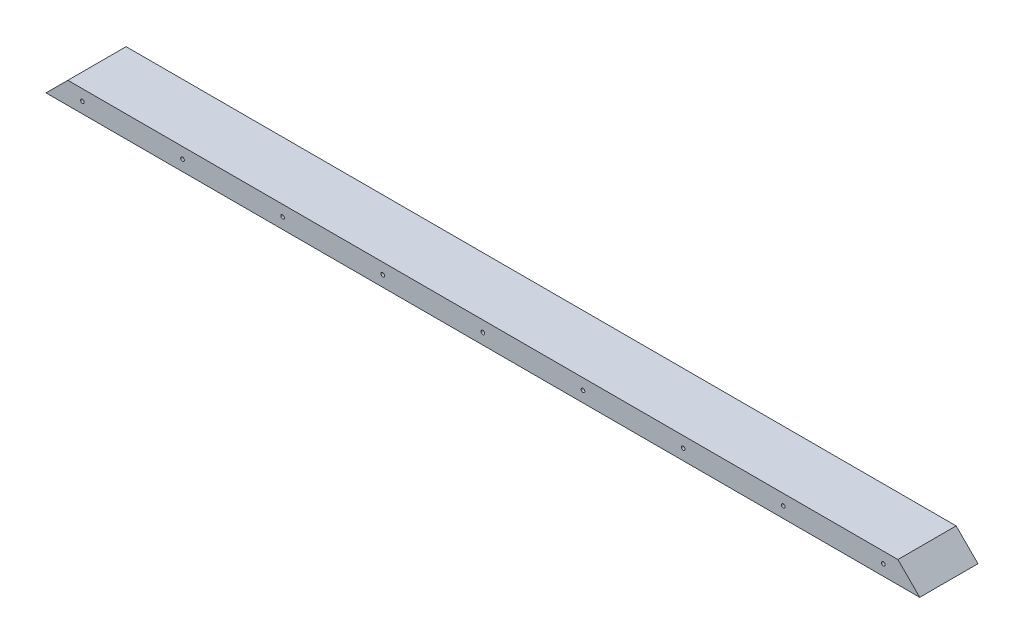
ISO-10303-21;
HEADER;
FILE_DESCRIPTION(('STEP AP214'),'2;1');
FILE_NAME('part.step','',(''),(''),'','','');
FILE_SCHEMA(('AUTOMOTIVE_DESIGN { 1 0 10303 214 1 1 1 1 }'));
ENDSEC;
DATA;
#1=APPLICATION_CONTEXT('core data for automotive mechanical design processes');
#2=APPLICATION_PROTOCOL_DEFINITION('international standard','automotive_design',2000,#1);
#3=PRODUCT_CONTEXT('',#1,'mechanical');
#4=PRODUCT('Part','Part','',(#3));
#5=PRODUCT_RELATED_PRODUCT_CATEGORY('part','',(#4));
#6=PRODUCT_DEFINITION_FORMATION('','',#4);
#7=PRODUCT_DEFINITION_CONTEXT('part definition',#1,'design');
#8=PRODUCT_DEFINITION('design','',#6,#7);
#9=PRODUCT_DEFINITION_SHAPE('','',#8);
#10=(LENGTH_UNIT() NAMED_UNIT(*) SI_UNIT(.MILLI.,.METRE.));
#11=(NAMED_UNIT(*) PLANE_ANGLE_UNIT() SI_UNIT($,.RADIAN.));
#12=(NAMED_UNIT(*) SI_UNIT($,.STERADIAN.) SOLID_ANGLE_UNIT());
#13=UNCERTAINTY_MEASURE_WITH_UNIT(LENGTH_MEASURE(1.E-05),#10,'distance_accuracy_value','');
#14=(GEOMETRIC_REPRESENTATION_CONTEXT(3) GLOBAL_UNCERTAINTY_ASSIGNED_CONTEXT((#13)) GLOBAL_UNIT_ASSIGNED_CONTEXT((#10,
#11,#12)) REPRESENTATION_CONTEXT('',''));
#15=CARTESIAN_POINT('',(0.,0.,0.));
#16=DIRECTION('',(0.,0.,1.));
#17=DIRECTION('',(1.,0.,0.));
#18=AXIS2_PLACEMENT_3D('',#15,#16,#17);
#19=CARTESIAN_POINT('',(600.,15.,20.));
#20=DIRECTION('',(0.,0.,-1.));
#21=DIRECTION('',(0.,1.,0.));
#22=AXIS2_PLACEMENT_3D('',#19,#20,#21);
#23=PLANE('',#22);
#24=CARTESIAN_POINT('',(300.,7.49999999999784,20.));
#25=DIRECTION('',(0.,0.,-1.));
#26=DIRECTION('',(0.,1.,0.));
#27=AXIS2_PLACEMENT_3D('',#24,#25,#26);
#28=CIRCLE('',#27,1.25000000000005);
#29=CARTESIAN_POINT('',(300.,8.74999999999788,20.));
#30=VERTEX_POINT('',#29);
#31=EDGE_CURVE('E170',#30,#30,#28,.T.);
#32=ORIENTED_EDGE('',*,*,#31,.T.);
#33=EDGE_LOOP('',(#32));
#34=FACE_BOUND('',#33,.T.);
#35=CARTESIAN_POINT('',(575.,7.49999999999584,20.));
#36=DIRECTION('',(0.,0.,-1.));
#37=DIRECTION('',(0.,-1.,0.));
#38=AXIS2_PLACEMENT_3D('',#35,#36,#37);
#39=CIRCLE('',#38,1.25000000000002);
#40=CARTESIAN_POINT('',(575.,6.24999999999582,20.));
#41=VERTEX_POINT('',#40);
#42=EDGE_CURVE('E137',#41,#41,#39,.T.);
#43=ORIENTED_EDGE('',*,*,#42,.T.);
#44=EDGE_LOOP('',(#43));
#45=FACE_BOUND('',#44,.T.);
#46=CARTESIAN_POINT('',(506.25,7.49999999999639,20.));
#47=DIRECTION('',(0.,0.,-1.));
#48=DIRECTION('',(0.,-1.,0.));
#49=AXIS2_PLACEMENT_3D('',#46,#47,#48);
#50=CIRCLE('',#49,1.25000000000005);
#51=CARTESIAN_POINT('',(506.25,6.24999999999635,20.));
#52=VERTEX_POINT('',#51);
#53=EDGE_CURVE('E131',#52,#52,#50,.T.);
#54=ORIENTED_EDGE('',*,*,#53,.T.);
#55=EDGE_LOOP('',(#54));
#56=FACE_BOUND('',#55,.T.);
#57=CARTESIAN_POINT('',(437.5,7.49999999999684,20.));
#58=DIRECTION('',(0.,0.,-1.));
#59=DIRECTION('',(0.,-1.,0.));
#60=AXIS2_PLACEMENT_3D('',#57,#58,#59);
#61=CIRCLE('',#60,1.25000000000005);
#62=CARTESIAN_POINT('',(437.5,6.24999999999679,20.));
#63=VERTEX_POINT('',#62);
#64=EDGE_CURVE('E125',#63,#63,#61,.T.);
#65=ORIENTED_EDGE('',*,*,#64,.T.);
#66=EDGE_LOOP('',(#65));
#67=FACE_BOUND('',#66,.T.);
#68=CARTESIAN_POINT('',(368.75,7.49999999999739,20.));
#69=DIRECTION('',(0.,0.,-1.));
#70=DIRECTION('',(0.,-1.,0.));
#71=AXIS2_PLACEMENT_3D('',#68,#69,#70);
#72=CIRCLE('',#71,1.25000000000008);
#73=CARTESIAN_POINT('',(368.75,6.24999999999731,20.));
#74=VERTEX_POINT('',#73);
#75=EDGE_CURVE('E119',#74,#74,#72,.T.);
#76=ORIENTED_EDGE('',*,*,#75,.T.);
#77=EDGE_LOOP('',(#76));
#78=FACE_BOUND('',#77,.T.);
#79=CARTESIAN_POINT('',(231.25,7.49999999999828,20.));
#80=DIRECTION('',(0.,0.,-1.));
#81=DIRECTION('',(0.,1.,0.));
#82=AXIS2_PLACEMENT_3D('',#79,#80,#81);
#83=CIRCLE('',#82,1.24999999999962);
#84=CARTESIAN_POINT('',(231.25,8.7499999999979,20.));
#85=VERTEX_POINT('',#84);
#86=EDGE_CURVE('E113',#85,#85,#83,.T.);
#87=ORIENTED_EDGE('',*,*,#86,.T.);
#88=EDGE_LOOP('',(#87));
#89=FACE_BOUND('',#88,.T.);
#90=CARTESIAN_POINT('',(162.5,7.49999999999872,20.));
#91=DIRECTION('',(0.,0.,-1.));
#92=DIRECTION('',(0.,1.,0.));
#93=AXIS2_PLACEMENT_3D('',#90,#91,#92);
#94=CIRCLE('',#93,1.25000000000002);
#95=CARTESIAN_POINT('',(162.5,8.74999999999874,20.));
#96=VERTEX_POINT('',#95);
#97=EDGE_CURVE('E107',#96,#96,#94,.T.);
#98=ORIENTED_EDGE('',*,*,#97,.T.);
#99=EDGE_LOOP('',(#98));
#100=FACE_BOUND('',#99,.T.);
#101=CARTESIAN_POINT('',(93.75,7.49999999999928,20.));
#102=DIRECTION('',(0.,0.,-1.));
#103=DIRECTION('',(0.,1.,0.));
#104=AXIS2_PLACEMENT_3D('',#101,#102,#103);
#105=CIRCLE('',#104,1.25000000000005);
#106=CARTESIAN_POINT('',(93.75,8.74999999999933,20.));
#107=VERTEX_POINT('',#106);
#108=EDGE_CURVE('E101',#107,#107,#105,.T.);
#109=ORIENTED_EDGE('',*,*,#108,.T.);
#110=EDGE_LOOP('',(#109));
#111=FACE_BOUND('',#110,.T.);
#112=CARTESIAN_POINT('',(24.9999999999999,7.49999999999972,20.));
#113=DIRECTION('',(0.,0.,-1.));
#114=DIRECTION('',(0.,1.,0.));
#115=AXIS2_PLACEMENT_3D('',#112,#113,#114);
#116=CIRCLE('',#115,1.25000000000005);
#117=CARTESIAN_POINT('',(24.9999999999999,8.74999999999977,20.));
#118=VERTEX_POINT('',#117);
#119=EDGE_CURVE('E95',#118,#118,#116,.T.);
#120=ORIENTED_EDGE('',*,*,#119,.T.);
#121=EDGE_LOOP('',(#120));
#122=FACE_BOUND('',#121,.T.);
#123=DIRECTION('',(-1.,0.,0.));
#124=VECTOR('',#123,1.);
#125=CARTESIAN_POINT('',(600.,0.,20.));
#126=LINE('',#125,#124);
#127=CARTESIAN_POINT('',(600.,0.,20.));
#128=VERTEX_POINT('',#127);
#129=CARTESIAN_POINT('',(0.,0.,20.));
#130=VERTEX_POINT('',#129);
#131=EDGE_CURVE('E41',#128,#130,#126,.T.);
#132=ORIENTED_EDGE('',*,*,#131,.F.);
#133=DIRECTION('',(-0.707106781186548,0.707106781186547,0.));
#134=VECTOR('',#133,1.);
#135=CARTESIAN_POINT('',(585.,15.,20.));
#136=LINE('',#135,#134);
#137=CARTESIAN_POINT('',(585.,15.,20.));
#138=VERTEX_POINT('',#137);
#139=EDGE_CURVE('E47',#128,#138,#136,.T.);
#140=ORIENTED_EDGE('',*,*,#139,.T.);
#141=DIRECTION('',(-1.,0.,0.));
#142=VECTOR('',#141,1.);
#143=CARTESIAN_POINT('',(600.,15.,20.));
#144=LINE('',#143,#142);
#145=CARTESIAN_POINT('',(15.,15.,20.));
#146=VERTEX_POINT('',#145);
#147=EDGE_CURVE('E11',#138,#146,#144,.T.);
#148=ORIENTED_EDGE('',*,*,#147,.T.);
#149=DIRECTION('',(-0.707106781186548,-0.707106781186547,0.));
#150=VECTOR('',#149,1.);
#151=CARTESIAN_POINT('',(15.,15.,20.));
#152=LINE('',#151,#150);
#153=EDGE_CURVE('E88',#146,#130,#152,.T.);
#154=ORIENTED_EDGE('',*,*,#153,.T.);
#155=EDGE_LOOP('',(#132,#140,#148,#154));
#156=FACE_BOUND('',#155,.T.);
#157=ADVANCED_FACE('F33',(#34,#45,#56,#67,#78,#89,#100,#111,#122,#156),#23,.F.);
#158=CARTESIAN_POINT('',(600.,0.,20.));
#159=DIRECTION('',(0.,1.,0.));
#160=DIRECTION('',(0.,0.,1.));
#161=AXIS2_PLACEMENT_3D('',#158,#159,#160);
#162=PLANE('',#161);
#163=DIRECTION('',(0.,0.,-1.));
#164=VECTOR('',#163,1.);
#165=CARTESIAN_POINT('',(0.,0.,20.));
#166=LINE('',#165,#164);
#167=CARTESIAN_POINT('',(0.,0.,-20.));
#168=VERTEX_POINT('',#167);
#169=EDGE_CURVE('E75',#130,#168,#166,.T.);
#170=ORIENTED_EDGE('',*,*,#169,.T.);
#171=DIRECTION('',(-1.,0.,0.));
#172=VECTOR('',#171,1.);
#173=CARTESIAN_POINT('',(600.,0.,-20.));
#174=LINE('',#173,#172);
#175=CARTESIAN_POINT('',(600.,0.,-20.));
#176=VERTEX_POINT('',#175);
#177=EDGE_CURVE('E143',#176,#168,#174,.T.);
#178=ORIENTED_EDGE('',*,*,#177,.F.);
#179=DIRECTION('',(0.,0.,-1.));
#180=VECTOR('',#179,1.);
#181=CARTESIAN_POINT('',(600.,0.,20.));
#182=LINE('',#181,#180);
#183=EDGE_CURVE('E138',#128,#176,#182,.T.);
#184=ORIENTED_EDGE('',*,*,#183,.F.);
#185=ORIENTED_EDGE('',*,*,#131,.T.);
#186=EDGE_LOOP('',(#170,#178,#184,#185));
#187=FACE_BOUND('',#186,.T.);
#188=ADVANCED_FACE('F146',(#187),#162,.F.);
#189=CARTESIAN_POINT('',(600.,0.,-20.));
#190=DIRECTION('',(0.,0.,1.));
#191=DIRECTION('',(0.,-1.,0.));
#192=AXIS2_PLACEMENT_3D('',#189,#190,#191);
#193=PLANE('',#192);
#194=CARTESIAN_POINT('',(300.,7.49999999999785,-20.));
#195=DIRECTION('',(0.,0.,-1.));
#196=DIRECTION('',(0.,1.,0.));
#197=AXIS2_PLACEMENT_3D('',#194,#195,#196);
#198=CIRCLE('',#197,1.25000000000005);
#199=CARTESIAN_POINT('',(300.,8.7499999999979,-20.));
#200=VERTEX_POINT('',#199);
#201=EDGE_CURVE('E325',#200,#200,#198,.T.);
#202=ORIENTED_EDGE('',*,*,#201,.F.);
#203=EDGE_LOOP('',(#202));
#204=FACE_BOUND('',#203,.T.);
#205=CARTESIAN_POINT('',(575.,7.49999999999585,-20.));
#206=DIRECTION('',(0.,0.,-1.));
#207=DIRECTION('',(0.,-1.,0.));
#208=AXIS2_PLACEMENT_3D('',#205,#206,#207);
#209=CIRCLE('',#208,1.25000000000002);
#210=CARTESIAN_POINT('',(575.,6.24999999999583,-20.));
#211=VERTEX_POINT('',#210);
#212=EDGE_CURVE('E327',#211,#211,#209,.T.);
#213=ORIENTED_EDGE('',*,*,#212,.F.);
#214=EDGE_LOOP('',(#213));
#215=FACE_BOUND('',#214,.T.);
#216=CARTESIAN_POINT('',(506.25,7.4999999999964,-20.));
#217=DIRECTION('',(0.,0.,-1.));
#218=DIRECTION('',(0.,-1.,0.));
#219=AXIS2_PLACEMENT_3D('',#216,#217,#218);
#220=CIRCLE('',#219,1.25000000000005);
#221=CARTESIAN_POINT('',(506.25,6.24999999999635,-20.));
#222=VERTEX_POINT('',#221);
#223=EDGE_CURVE('E134',#222,#222,#220,.T.);
#224=ORIENTED_EDGE('',*,*,#223,.F.);
#225=EDGE_LOOP('',(#224));
#226=FACE_BOUND('',#225,.T.);
#227=CARTESIAN_POINT('',(437.5,7.49999999999685,-20.));
#228=DIRECTION('',(0.,0.,-1.));
#229=DIRECTION('',(0.,-1.,0.));
#230=AXIS2_PLACEMENT_3D('',#227,#228,#229);
#231=CIRCLE('',#230,1.25000000000005);
#232=CARTESIAN_POINT('',(437.5,6.2499999999968,-20.));
#233=VERTEX_POINT('',#232);
#234=EDGE_CURVE('E128',#233,#233,#231,.T.);
#235=ORIENTED_EDGE('',*,*,#234,.F.);
#236=EDGE_LOOP('',(#235));
#237=FACE_BOUND('',#236,.T.);
#238=CARTESIAN_POINT('',(368.75,7.4999999999974,-20.));
#239=DIRECTION('',(0.,0.,-1.));
#240=DIRECTION('',(0.,-1.,0.));
#241=AXIS2_PLACEMENT_3D('',#238,#239,#240);
#242=CIRCLE('',#241,1.25000000000008);
#243=CARTESIAN_POINT('',(368.75,6.24999999999732,-20.));
#244=VERTEX_POINT('',#243);
#245=EDGE_CURVE('E122',#244,#244,#242,.T.);
#246=ORIENTED_EDGE('',*,*,#245,.F.);
#247=EDGE_LOOP('',(#246));
#248=FACE_BOUND('',#247,.T.);
#249=CARTESIAN_POINT('',(231.25,7.49999999999829,-20.));
#250=DIRECTION('',(0.,0.,-1.));
#251=DIRECTION('',(0.,1.,0.));
#252=AXIS2_PLACEMENT_3D('',#249,#250,#251);
#253=CIRCLE('',#252,1.24999999999962);
#254=CARTESIAN_POINT('',(231.25,8.74999999999791,-20.));
#255=VERTEX_POINT('',#254);
#256=EDGE_CURVE('E116',#255,#255,#253,.T.);
#257=ORIENTED_EDGE('',*,*,#256,.F.);
#258=EDGE_LOOP('',(#257));
#259=FACE_BOUND('',#258,.T.);
#260=CARTESIAN_POINT('',(162.5,7.49999999999873,-20.));
#261=DIRECTION('',(0.,0.,-1.));
#262=DIRECTION('',(0.,1.,0.));
#263=AXIS2_PLACEMENT_3D('',#260,#261,#262);
#264=CIRCLE('',#263,1.25000000000002);
#265=CARTESIAN_POINT('',(162.5,8.74999999999875,-20.));
#266=VERTEX_POINT('',#265);
#267=EDGE_CURVE('E110',#266,#266,#264,.T.);
#268=ORIENTED_EDGE('',*,*,#267,.F.);
#269=EDGE_LOOP('',(#268));
#270=FACE_BOUND('',#269,.T.);
#271=CARTESIAN_POINT('',(93.75,7.49999999999929,-20.));
#272=DIRECTION('',(0.,0.,-1.));
#273=DIRECTION('',(0.,1.,0.));
#274=AXIS2_PLACEMENT_3D('',#271,#272,#273);
#275=CIRCLE('',#274,1.25000000000005);
#276=CARTESIAN_POINT('',(93.75,8.74999999999934,-20.));
#277=VERTEX_POINT('',#276);
#278=EDGE_CURVE('E104',#277,#277,#275,.T.);
#279=ORIENTED_EDGE('',*,*,#278,.F.);
#280=EDGE_LOOP('',(#279));
#281=FACE_BOUND('',#280,.T.);
#282=CARTESIAN_POINT('',(24.9999999999999,7.49999999999973,-20.));
#283=DIRECTION('',(0.,0.,-1.));
#284=DIRECTION('',(0.,1.,0.));
#285=AXIS2_PLACEMENT_3D('',#282,#283,#284);
#286=CIRCLE('',#285,1.25000000000005);
#287=CARTESIAN_POINT('',(24.9999999999999,8.74999999999978,-20.));
#288=VERTEX_POINT('',#287);
#289=EDGE_CURVE('E98',#288,#288,#286,.T.);
#290=ORIENTED_EDGE('',*,*,#289,.F.);
#291=EDGE_LOOP('',(#290));
#292=FACE_BOUND('',#291,.T.);
#293=DIRECTION('',(-1.,0.,0.));
#294=VECTOR('',#293,1.);
#295=CARTESIAN_POINT('',(600.,15.,-20.));
#296=LINE('',#295,#294);
#297=CARTESIAN_POINT('',(585.,15.,-20.));
#298=VERTEX_POINT('',#297);
#299=CARTESIAN_POINT('',(15.,15.,-20.));
#300=VERTEX_POINT('',#299);
#301=EDGE_CURVE('E85',#298,#300,#296,.T.);
#302=ORIENTED_EDGE('',*,*,#301,.F.);
#303=DIRECTION('',(-0.707106781186548,0.707106781186547,0.));
#304=VECTOR('',#303,1.);
#305=CARTESIAN_POINT('',(585.,15.,-20.));
#306=LINE('',#305,#304);
#307=EDGE_CURVE('E70',#176,#298,#306,.T.);
#308=ORIENTED_EDGE('',*,*,#307,.F.);
#309=ORIENTED_EDGE('',*,*,#177,.T.);
#310=DIRECTION('',(-0.707106781186548,-0.707106781186547,0.));
#311=VECTOR('',#310,1.);
#312=CARTESIAN_POINT('',(15.,15.,-20.));
#313=LINE('',#312,#311);
#314=EDGE_CURVE('E91',#300,#168,#313,.T.);
#315=ORIENTED_EDGE('',*,*,#314,.F.);
#316=EDGE_LOOP('',(#302,#308,#309,#315));
#317=FACE_BOUND('',#316,.T.);
#318=ADVANCED_FACE('F149',(#204,#215,#226,#237,#248,#259,#270,#281,#292,#317),#193,.F.);
#319=CARTESIAN_POINT('',(600.,15.,-20.));
#320=DIRECTION('',(0.,-1.,0.));
#321=DIRECTION('',(0.,0.,-1.));
#322=AXIS2_PLACEMENT_3D('',#319,#320,#321);
#323=PLANE('',#322);
#324=ORIENTED_EDGE('',*,*,#147,.F.);
#325=DIRECTION('',(0.,0.,-1.));
#326=VECTOR('',#325,1.);
#327=CARTESIAN_POINT('',(585.,15.,20.));
#328=LINE('',#327,#326);
#329=EDGE_CURVE('E67',#138,#298,#328,.T.);
#330=ORIENTED_EDGE('',*,*,#329,.T.);
#331=ORIENTED_EDGE('',*,*,#301,.T.);
#332=DIRECTION('',(0.,0.,-1.));
#333=VECTOR('',#332,1.);
#334=CARTESIAN_POINT('',(15.,15.,20.));
#335=LINE('',#334,#333);
#336=EDGE_CURVE('E84',#146,#300,#335,.T.);
#337=ORIENTED_EDGE('',*,*,#336,.F.);
#338=EDGE_LOOP('',(#324,#330,#331,#337));
#339=FACE_BOUND('',#338,.T.);
#340=ADVANCED_FACE('F83',(#339),#323,.F.);
#341=CARTESIAN_POINT('',(15.,15.,20.));
#342=DIRECTION('',(0.707106781186547,-0.707106781186548,0.));
#343=DIRECTION('',(0.707106781186548,0.707106781186547,0.));
#344=AXIS2_PLACEMENT_3D('',#341,#342,#343);
#345=PLANE('',#344);
#346=ORIENTED_EDGE('',*,*,#314,.T.);
#347=ORIENTED_EDGE('',*,*,#169,.F.);
#348=ORIENTED_EDGE('',*,*,#153,.F.);
#349=ORIENTED_EDGE('',*,*,#336,.T.);
#350=EDGE_LOOP('',(#346,#347,#348,#349));
#351=FACE_BOUND('',#350,.T.);
#352=ADVANCED_FACE('F150',(#351),#345,.F.);
#353=CARTESIAN_POINT('',(585.,15.,20.));
#354=DIRECTION('',(-0.707106781186547,-0.707106781186548,0.));
#355=DIRECTION('',(0.707106781186548,-0.707106781186547,0.));
#356=AXIS2_PLACEMENT_3D('',#353,#354,#355);
#357=PLANE('',#356);
#358=ORIENTED_EDGE('',*,*,#307,.T.);
#359=ORIENTED_EDGE('',*,*,#329,.F.);
#360=ORIENTED_EDGE('',*,*,#139,.F.);
#361=ORIENTED_EDGE('',*,*,#183,.T.);
#362=EDGE_LOOP('',(#358,#359,#360,#361));
#363=FACE_BOUND('',#362,.T.);
#364=ADVANCED_FACE('F68',(#363),#357,.F.);
#365=CARTESIAN_POINT('',(24.9999999999999,7.49999999999972,20.));
#366=DIRECTION('',(0.,0.,-1.));
#367=DIRECTION('',(0.,1.,0.));
#368=AXIS2_PLACEMENT_3D('',#365,#366,#367);
#369=CYLINDRICAL_SURFACE('',#368,1.25000000000005);
#370=ORIENTED_EDGE('',*,*,#119,.F.);
#371=EDGE_LOOP('',(#370));
#372=FACE_BOUND('',#371,.T.);
#373=ORIENTED_EDGE('',*,*,#289,.T.);
#374=EDGE_LOOP('',(#373));
#375=FACE_BOUND('',#374,.T.);
#376=ADVANCED_FACE('F157',(#372,#375),#369,.F.);
#377=CARTESIAN_POINT('',(93.75,7.49999999999928,20.));
#378=DIRECTION('',(0.,0.,-1.));
#379=DIRECTION('',(0.,1.,0.));
#380=AXIS2_PLACEMENT_3D('',#377,#378,#379);
#381=CYLINDRICAL_SURFACE('',#380,1.25000000000005);
#382=ORIENTED_EDGE('',*,*,#108,.F.);
#383=EDGE_LOOP('',(#382));
#384=FACE_BOUND('',#383,.T.);
#385=ORIENTED_EDGE('',*,*,#278,.T.);
#386=EDGE_LOOP('',(#385));
#387=FACE_BOUND('',#386,.T.);
#388=ADVANCED_FACE('F190',(#384,#387),#381,.F.);
#389=CARTESIAN_POINT('',(162.5,7.49999999999872,20.));
#390=DIRECTION('',(0.,0.,-1.));
#391=DIRECTION('',(0.,1.,0.));
#392=AXIS2_PLACEMENT_3D('',#389,#390,#391);
#393=CYLINDRICAL_SURFACE('',#392,1.25000000000002);
#394=ORIENTED_EDGE('',*,*,#97,.F.);
#395=EDGE_LOOP('',(#394));
#396=FACE_BOUND('',#395,.T.);
#397=ORIENTED_EDGE('',*,*,#267,.T.);
#398=EDGE_LOOP('',(#397));
#399=FACE_BOUND('',#398,.T.);
#400=ADVANCED_FACE('F217',(#396,#399),#393,.F.);
#401=CARTESIAN_POINT('',(231.25,7.49999999999828,20.));
#402=DIRECTION('',(0.,0.,-1.));
#403=DIRECTION('',(0.,1.,0.));
#404=AXIS2_PLACEMENT_3D('',#401,#402,#403);
#405=CYLINDRICAL_SURFACE('',#404,1.24999999999962);
#406=ORIENTED_EDGE('',*,*,#86,.F.);
#407=EDGE_LOOP('',(#406));
#408=FACE_BOUND('',#407,.T.);
#409=ORIENTED_EDGE('',*,*,#256,.T.);
#410=EDGE_LOOP('',(#409));
#411=FACE_BOUND('',#410,.T.);
#412=ADVANCED_FACE('F213',(#408,#411),#405,.F.);
#413=CARTESIAN_POINT('',(368.75,7.49999999999739,20.));
#414=DIRECTION('',(0.,0.,-1.));
#415=DIRECTION('',(0.,1.,0.));
#416=AXIS2_PLACEMENT_3D('',#413,#414,#415);
#417=CYLINDRICAL_SURFACE('',#416,1.25000000000008);
#418=ORIENTED_EDGE('',*,*,#75,.F.);
#419=EDGE_LOOP('',(#418));
#420=FACE_BOUND('',#419,.T.);
#421=ORIENTED_EDGE('',*,*,#245,.T.);
#422=EDGE_LOOP('',(#421));
#423=FACE_BOUND('',#422,.T.);
#424=ADVANCED_FACE('F209',(#420,#423),#417,.F.);
#425=CARTESIAN_POINT('',(437.5,7.49999999999684,20.));
#426=DIRECTION('',(0.,0.,-1.));
#427=DIRECTION('',(0.,1.,0.));
#428=AXIS2_PLACEMENT_3D('',#425,#426,#427);
#429=CYLINDRICAL_SURFACE('',#428,1.25000000000005);
#430=ORIENTED_EDGE('',*,*,#64,.F.);
#431=EDGE_LOOP('',(#430));
#432=FACE_BOUND('',#431,.T.);
#433=ORIENTED_EDGE('',*,*,#234,.T.);
#434=EDGE_LOOP('',(#433));
#435=FACE_BOUND('',#434,.T.);
#436=ADVANCED_FACE('F205',(#432,#435),#429,.F.);
#437=CARTESIAN_POINT('',(506.25,7.49999999999639,20.));
#438=DIRECTION('',(0.,0.,-1.));
#439=DIRECTION('',(0.,1.,0.));
#440=AXIS2_PLACEMENT_3D('',#437,#438,#439);
#441=CYLINDRICAL_SURFACE('',#440,1.25000000000005);
#442=ORIENTED_EDGE('',*,*,#53,.F.);
#443=EDGE_LOOP('',(#442));
#444=FACE_BOUND('',#443,.T.);
#445=ORIENTED_EDGE('',*,*,#223,.T.);
#446=EDGE_LOOP('',(#445));
#447=FACE_BOUND('',#446,.T.);
#448=ADVANCED_FACE('F201',(#444,#447),#441,.F.);
#449=CARTESIAN_POINT('',(575.,7.49999999999584,20.));
#450=DIRECTION('',(0.,0.,-1.));
#451=DIRECTION('',(0.,1.,0.));
#452=AXIS2_PLACEMENT_3D('',#449,#450,#451);
#453=CYLINDRICAL_SURFACE('',#452,1.25000000000002);
#454=ORIENTED_EDGE('',*,*,#42,.F.);
#455=EDGE_LOOP('',(#454));
#456=FACE_BOUND('',#455,.T.);
#457=ORIENTED_EDGE('',*,*,#212,.T.);
#458=EDGE_LOOP('',(#457));
#459=FACE_BOUND('',#458,.T.);
#460=ADVANCED_FACE('F204',(#456,#459),#453,.F.);
#461=CARTESIAN_POINT('',(300.,7.49999999999784,20.));
#462=DIRECTION('',(0.,0.,-1.));
#463=DIRECTION('',(0.,1.,0.));
#464=AXIS2_PLACEMENT_3D('',#461,#462,#463);
#465=CYLINDRICAL_SURFACE('',#464,1.25000000000005);
#466=ORIENTED_EDGE('',*,*,#31,.F.);
#467=EDGE_LOOP('',(#466));
#468=FACE_BOUND('',#467,.T.);
#469=ORIENTED_EDGE('',*,*,#201,.T.);
#470=EDGE_LOOP('',(#469));
#471=FACE_BOUND('',#470,.T.);
#472=ADVANCED_FACE('F257',(#468,#471),#465,.F.);
#473=CLOSED_SHELL('',(#157,#188,#318,#340,#352,#364,#376,#388,#400,#412,#424,#436,#448,#460,#472));
#474=MANIFOLD_SOLID_BREP('B2',#473);
#475=ADVANCED_BREP_SHAPE_REPRESENTATION('',(#18,#474),#14);
#476=SHAPE_DEFINITION_REPRESENTATION(#9,#475);
ENDSEC;
END-ISO-10303-21;
